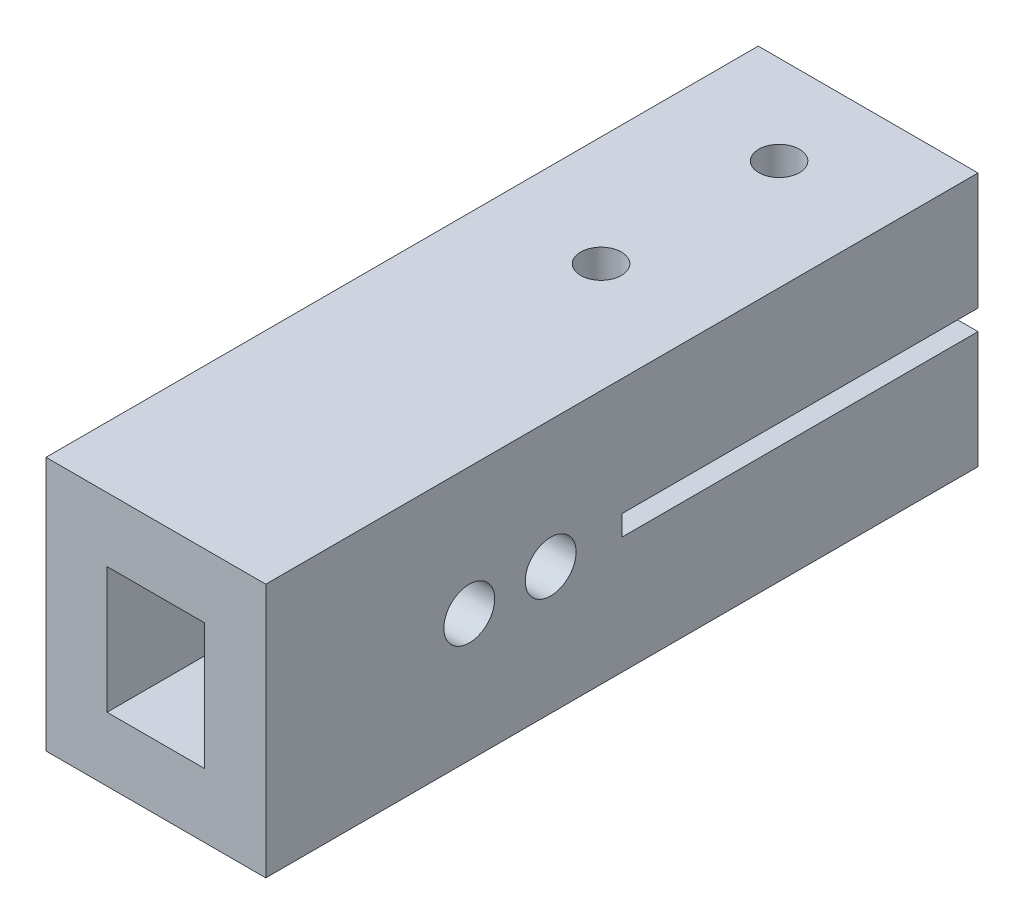
ISO-10303-21;
HEADER;
FILE_DESCRIPTION(('STEP AP214'),'2;1');
FILE_NAME('part.step','',(''),(''),'','','');
FILE_SCHEMA(('AUTOMOTIVE_DESIGN { 1 0 10303 214 1 1 1 1 }'));
ENDSEC;
DATA;
#1=APPLICATION_CONTEXT('core data for automotive mechanical design processes');
#2=APPLICATION_PROTOCOL_DEFINITION('international standard','automotive_design',2000,#1);
#3=PRODUCT_CONTEXT('',#1,'mechanical');
#4=PRODUCT('Part','Part','',(#3));
#5=PRODUCT_RELATED_PRODUCT_CATEGORY('part','',(#4));
#6=PRODUCT_DEFINITION_FORMATION('','',#4);
#7=PRODUCT_DEFINITION_CONTEXT('part definition',#1,'design');
#8=PRODUCT_DEFINITION('design','',#6,#7);
#9=PRODUCT_DEFINITION_SHAPE('','',#8);
#10=(LENGTH_UNIT() NAMED_UNIT(*) SI_UNIT(.MILLI.,.METRE.));
#11=(NAMED_UNIT(*) PLANE_ANGLE_UNIT() SI_UNIT($,.RADIAN.));
#12=(NAMED_UNIT(*) SI_UNIT($,.STERADIAN.) SOLID_ANGLE_UNIT());
#13=UNCERTAINTY_MEASURE_WITH_UNIT(LENGTH_MEASURE(1.E-05),#10,'distance_accuracy_value','');
#14=(GEOMETRIC_REPRESENTATION_CONTEXT(3) GLOBAL_UNCERTAINTY_ASSIGNED_CONTEXT((#13)) GLOBAL_UNIT_ASSIGNED_CONTEXT((#10,
#11,#12)) REPRESENTATION_CONTEXT('',''));
#15=CARTESIAN_POINT('',(0.,0.,0.));
#16=DIRECTION('',(0.,0.,1.));
#17=DIRECTION('',(1.,0.,0.));
#18=AXIS2_PLACEMENT_3D('',#15,#16,#17);
#19=CARTESIAN_POINT('',(-56.5626148851494,0.,-10.849521595488));
#20=DIRECTION('',(0.,0.,1.));
#21=DIRECTION('',(1.,0.,0.));
#22=AXIS2_PLACEMENT_3D('',#19,#20,#21);
#23=PLANE('',#22);
#24=DIRECTION('',(0.,-1.,0.));
#25=VECTOR('',#24,1.);
#26=CARTESIAN_POINT('',(-54.1626148851493,3.10000000000004,-10.849521595488));
#27=LINE('',#26,#25);
#28=CARTESIAN_POINT('',(-54.1626148851493,3.10000000000004,-10.849521595488));
#29=VERTEX_POINT('',#28);
#30=CARTESIAN_POINT('',(-54.1626148851493,-3.09999999999995,-10.849521595488));
#31=VERTEX_POINT('',#30);
#32=EDGE_CURVE('E11',#29,#31,#27,.T.);
#33=ORIENTED_EDGE('',*,*,#32,.T.);
#34=DIRECTION('',(-1.,0.,0.));
#35=VECTOR('',#34,1.);
#36=CARTESIAN_POINT('',(-54.1626148851493,-3.09999999999995,-10.849521595488));
#37=LINE('',#36,#35);
#38=CARTESIAN_POINT('',(-58.9626148851493,-3.09999999999995,-10.849521595488));
#39=VERTEX_POINT('',#38);
#40=EDGE_CURVE('E26',#31,#39,#37,.T.);
#41=ORIENTED_EDGE('',*,*,#40,.T.);
#42=DIRECTION('',(0.,1.,0.));
#43=VECTOR('',#42,1.);
#44=CARTESIAN_POINT('',(-58.9626148851493,-3.09999999999995,-10.849521595488));
#45=LINE('',#44,#43);
#46=CARTESIAN_POINT('',(-58.9626148851493,3.10000000000004,-10.849521595488));
#47=VERTEX_POINT('',#46);
#48=EDGE_CURVE('E393',#39,#47,#45,.T.);
#49=ORIENTED_EDGE('',*,*,#48,.T.);
#50=DIRECTION('',(1.,0.,0.));
#51=VECTOR('',#50,1.);
#52=CARTESIAN_POINT('',(-58.9626148851493,3.10000000000004,-10.849521595488));
#53=LINE('',#52,#51);
#54=EDGE_CURVE('E396',#47,#29,#53,.T.);
#55=ORIENTED_EDGE('',*,*,#54,.T.);
#56=EDGE_LOOP('',(#33,#41,#49,#55));
#57=FACE_BOUND('',#56,.T.);
#58=DIRECTION('',(0.,-1.,0.));
#59=VECTOR('',#58,1.);
#60=CARTESIAN_POINT('',(-61.9626148851493,6.25,-10.849521595488));
#61=LINE('',#60,#59);
#62=CARTESIAN_POINT('',(-61.9626148851493,6.25,-10.849521595488));
#63=VERTEX_POINT('',#62);
#64=CARTESIAN_POINT('',(-61.9626148851493,-6.25,-10.849521595488));
#65=VERTEX_POINT('',#64);
#66=EDGE_CURVE('E421',#63,#65,#61,.T.);
#67=ORIENTED_EDGE('',*,*,#66,.T.);
#68=DIRECTION('',(1.,0.,0.));
#69=VECTOR('',#68,1.);
#70=CARTESIAN_POINT('',(-61.9626148851493,-6.25,-10.849521595488));
#71=LINE('',#70,#69);
#72=CARTESIAN_POINT('',(-51.1626148851493,-6.25,-10.849521595488));
#73=VERTEX_POINT('',#72);
#74=EDGE_CURVE('E329',#65,#73,#71,.T.);
#75=ORIENTED_EDGE('',*,*,#74,.T.);
#76=DIRECTION('',(0.,1.,0.));
#77=VECTOR('',#76,1.);
#78=CARTESIAN_POINT('',(-51.1626148851493,-6.25,-10.849521595488));
#79=LINE('',#78,#77);
#80=CARTESIAN_POINT('',(-51.1626148851493,6.25,-10.849521595488));
#81=VERTEX_POINT('',#80);
#82=EDGE_CURVE('E326',#73,#81,#79,.T.);
#83=ORIENTED_EDGE('',*,*,#82,.T.);
#84=DIRECTION('',(-1.,0.,0.));
#85=VECTOR('',#84,1.);
#86=CARTESIAN_POINT('',(-51.1626148851493,6.25,-10.849521595488));
#87=LINE('',#86,#85);
#88=EDGE_CURVE('E330',#81,#63,#87,.T.);
#89=ORIENTED_EDGE('',*,*,#88,.T.);
#90=EDGE_LOOP('',(#67,#75,#83,#89));
#91=FACE_BOUND('',#90,.T.);
#92=ADVANCED_FACE('F16',(#57,#91),#23,.T.);
#93=CARTESIAN_POINT('',(-58.9626148851493,-6.25,-45.849521595488));
#94=DIRECTION('',(0.,-1.,0.));
#95=DIRECTION('',(0.,0.,1.));
#96=AXIS2_PLACEMENT_3D('',#93,#94,#95);
#97=PLANE('',#96);
#98=DIRECTION('',(0.,0.,1.));
#99=VECTOR('',#98,1.);
#100=CARTESIAN_POINT('',(-61.9626148851493,-6.25,-11.849521595488));
#101=LINE('',#100,#99);
#102=CARTESIAN_POINT('',(-61.9626148851493,-6.25,-45.849521595488));
#103=VERTEX_POINT('',#102);
#104=EDGE_CURVE('E352',#103,#65,#101,.T.);
#105=ORIENTED_EDGE('',*,*,#104,.F.);
#106=DIRECTION('',(1.,0.,0.));
#107=VECTOR('',#106,1.);
#108=CARTESIAN_POINT('',(-58.9626148851493,-6.25,-45.849521595488));
#109=LINE('',#108,#107);
#110=CARTESIAN_POINT('',(-51.1626148851493,-6.25,-45.849521595488));
#111=VERTEX_POINT('',#110);
#112=EDGE_CURVE('E293',#103,#111,#109,.T.);
#113=ORIENTED_EDGE('',*,*,#112,.T.);
#114=DIRECTION('',(0.,0.,-1.));
#115=VECTOR('',#114,1.);
#116=CARTESIAN_POINT('',(-51.1626148851493,-6.25,-38.3495215954879));
#117=LINE('',#116,#115);
#118=EDGE_CURVE('E392',#73,#111,#117,.T.);
#119=ORIENTED_EDGE('',*,*,#118,.F.);
#120=ORIENTED_EDGE('',*,*,#74,.F.);
#121=EDGE_LOOP('',(#105,#113,#119,#120));
#122=FACE_BOUND('',#121,.T.);
#123=CARTESIAN_POINT('',(-56.5626148851493,-6.25,-32.7245215954879));
#124=DIRECTION('',(0.,1.,0.));
#125=DIRECTION('',(-1.,0.,0.));
#126=AXIS2_PLACEMENT_3D('',#123,#124,#125);
#127=CIRCLE('',#126,1.);
#128=CARTESIAN_POINT('',(-55.5626148851493,-6.25,-32.7245215954879));
#129=VERTEX_POINT('',#128);
#130=EDGE_CURVE('E291',#129,#129,#127,.T.);
#131=ORIENTED_EDGE('',*,*,#130,.T.);
#132=EDGE_LOOP('',(#131));
#133=FACE_BOUND('',#132,.T.);
#134=CARTESIAN_POINT('',(-56.5626148851493,-6.25,-41.4745215954879));
#135=DIRECTION('',(0.,1.,0.));
#136=DIRECTION('',(-1.,0.,0.));
#137=AXIS2_PLACEMENT_3D('',#134,#135,#136);
#138=CIRCLE('',#137,1.);
#139=CARTESIAN_POINT('',(-55.5626148851493,-6.25,-41.4745215954879));
#140=VERTEX_POINT('',#139);
#141=EDGE_CURVE('E267',#140,#140,#138,.T.);
#142=ORIENTED_EDGE('',*,*,#141,.T.);
#143=EDGE_LOOP('',(#142));
#144=FACE_BOUND('',#143,.T.);
#145=ADVANCED_FACE('F496',(#122,#133,#144),#97,.T.);
#146=CARTESIAN_POINT('',(-61.9626148851493,-1.24999999999995,-30.849521595488));
#147=DIRECTION('',(-1.,0.,0.));
#148=DIRECTION('',(0.,-1.,0.));
#149=AXIS2_PLACEMENT_3D('',#146,#147,#148);
#150=PLANE('',#149);
#151=CARTESIAN_POINT('',(-61.9626148851493,0.,-24.8495215954879));
#152=DIRECTION('',(1.,0.,0.));
#153=DIRECTION('',(0.,-1.,0.));
#154=AXIS2_PLACEMENT_3D('',#151,#152,#153);
#155=CIRCLE('',#154,1.25);
#156=CARTESIAN_POINT('',(-61.9626148851493,1.25000000000005,-24.8495215954879));
#157=VERTEX_POINT('',#156);
#158=EDGE_CURVE('E264',#157,#157,#155,.T.);
#159=ORIENTED_EDGE('',*,*,#158,.T.);
#160=EDGE_LOOP('',(#159));
#161=FACE_BOUND('',#160,.T.);
#162=CARTESIAN_POINT('',(-61.9626148851493,0.,-20.8495215954879));
#163=DIRECTION('',(1.,0.,0.));
#164=DIRECTION('',(0.,-1.,0.));
#165=AXIS2_PLACEMENT_3D('',#162,#163,#164);
#166=CIRCLE('',#165,1.25);
#167=CARTESIAN_POINT('',(-61.9626148851493,1.25000000000005,-20.8495215954879));
#168=VERTEX_POINT('',#167);
#169=EDGE_CURVE('E268',#168,#168,#166,.T.);
#170=ORIENTED_EDGE('',*,*,#169,.T.);
#171=EDGE_LOOP('',(#170));
#172=FACE_BOUND('',#171,.T.);
#173=DIRECTION('',(0.,0.,-1.));
#174=VECTOR('',#173,1.);
#175=CARTESIAN_POINT('',(-61.9626148851493,6.25,-38.3495215954879));
#176=LINE('',#175,#174);
#177=CARTESIAN_POINT('',(-61.9626148851493,6.25,-45.849521595488));
#178=VERTEX_POINT('',#177);
#179=EDGE_CURVE('E343',#63,#178,#176,.T.);
#180=ORIENTED_EDGE('',*,*,#179,.T.);
#181=DIRECTION('',(0.,-1.,0.));
#182=VECTOR('',#181,1.);
#183=CARTESIAN_POINT('',(-61.9626148851493,1.87500000000005,-45.849521595488));
#184=LINE('',#183,#182);
#185=CARTESIAN_POINT('',(-61.9626148851493,0.500000000000049,-45.849521595488));
#186=VERTEX_POINT('',#185);
#187=EDGE_CURVE('E346',#178,#186,#184,.T.);
#188=ORIENTED_EDGE('',*,*,#187,.T.);
#189=DIRECTION('',(0.,0.,1.));
#190=VECTOR('',#189,1.);
#191=CARTESIAN_POINT('',(-61.9626148851493,0.500000000000049,-38.3495215954879));
#192=LINE('',#191,#190);
#193=CARTESIAN_POINT('',(-61.9626148851493,0.500000000000049,-28.3495215954879));
#194=VERTEX_POINT('',#193);
#195=EDGE_CURVE('E231',#186,#194,#192,.T.);
#196=ORIENTED_EDGE('',*,*,#195,.T.);
#197=DIRECTION('',(0.,-1.,0.));
#198=VECTOR('',#197,1.);
#199=CARTESIAN_POINT('',(-61.9626148851493,-0.624999999999952,-28.3495215954879));
#200=LINE('',#199,#198);
#201=CARTESIAN_POINT('',(-61.9626148851493,-0.499999999999951,-28.3495215954879));
#202=VERTEX_POINT('',#201);
#203=EDGE_CURVE('E375',#194,#202,#200,.T.);
#204=ORIENTED_EDGE('',*,*,#203,.T.);
#205=DIRECTION('',(0.,0.,-1.));
#206=VECTOR('',#205,1.);
#207=CARTESIAN_POINT('',(-61.9626148851493,-0.499999999999951,-38.3495215954879));
#208=LINE('',#207,#206);
#209=CARTESIAN_POINT('',(-61.9626148851493,-0.499999999999951,-45.849521595488));
#210=VERTEX_POINT('',#209);
#211=EDGE_CURVE('E378',#202,#210,#208,.T.);
#212=ORIENTED_EDGE('',*,*,#211,.T.);
#213=DIRECTION('',(0.,-1.,0.));
#214=VECTOR('',#213,1.);
#215=CARTESIAN_POINT('',(-61.9626148851493,1.87500000000005,-45.849521595488));
#216=LINE('',#215,#214);
#217=EDGE_CURVE('E358',#210,#103,#216,.T.);
#218=ORIENTED_EDGE('',*,*,#217,.T.);
#219=ORIENTED_EDGE('',*,*,#104,.T.);
#220=ORIENTED_EDGE('',*,*,#66,.F.);
#221=EDGE_LOOP('',(#180,#188,#196,#204,#212,#218,#219,#220));
#222=FACE_BOUND('',#221,.T.);
#223=ADVANCED_FACE('F498',(#161,#172,#222),#150,.T.);
#224=CARTESIAN_POINT('',(-54.1626148851493,0.750000000000047,-30.849521595488));
#225=DIRECTION('',(1.,0.,0.));
#226=DIRECTION('',(0.,1.,0.));
#227=AXIS2_PLACEMENT_3D('',#224,#225,#226);
#228=PLANE('',#227);
#229=CARTESIAN_POINT('',(-54.1626148851493,0.,-20.8495215954879));
#230=DIRECTION('',(-1.,0.,0.));
#231=DIRECTION('',(0.,0.973831149346752,-0.227272727272728));
#232=AXIS2_PLACEMENT_3D('',#229,#230,#231);
#233=CIRCLE('',#232,2.8);
#234=CARTESIAN_POINT('',(-54.1626148851493,-2.72672721817087,-21.4858852318516));
#235=VERTEX_POINT('',#234);
#236=CARTESIAN_POINT('',(-54.1626148851493,2.72672721817096,-21.4858852318516));
#237=VERTEX_POINT('',#236);
#238=EDGE_CURVE('E311',#235,#237,#233,.T.);
#239=ORIENTED_EDGE('',*,*,#238,.F.);
#240=CARTESIAN_POINT('',(-54.1626148851493,-8.56971411425136,-22.849521595488));
#241=DIRECTION('',(1.,0.,0.));
#242=DIRECTION('',(0.,0.973831149346752,-0.227272727272727));
#243=AXIS2_PLACEMENT_3D('',#240,#241,#242);
#244=CIRCLE('',#243,6.);
#245=CARTESIAN_POINT('',(-54.1626148851493,-2.72672721817086,-24.2131579591244));
#246=VERTEX_POINT('',#245);
#247=EDGE_CURVE('E306',#246,#235,#244,.T.);
#248=ORIENTED_EDGE('',*,*,#247,.F.);
#249=CARTESIAN_POINT('',(-54.1626148851493,0.,-24.8495215954879));
#250=DIRECTION('',(-1.,0.,0.));
#251=DIRECTION('',(0.,-0.973831149346752,0.227272727272728));
#252=AXIS2_PLACEMENT_3D('',#249,#250,#251);
#253=CIRCLE('',#252,2.8);
#254=CARTESIAN_POINT('',(-54.1626148851493,2.72672721817096,-24.2131579591244));
#255=VERTEX_POINT('',#254);
#256=EDGE_CURVE('E307',#255,#246,#253,.T.);
#257=ORIENTED_EDGE('',*,*,#256,.F.);
#258=CARTESIAN_POINT('',(-54.1626148851493,8.56971411425149,-22.849521595488));
#259=DIRECTION('',(1.,0.,0.));
#260=DIRECTION('',(0.,-0.973831149346752,0.227272727272728));
#261=AXIS2_PLACEMENT_3D('',#258,#259,#260);
#262=CIRCLE('',#261,6.);
#263=EDGE_CURVE('E325',#237,#255,#262,.T.);
#264=ORIENTED_EDGE('',*,*,#263,.F.);
#265=EDGE_LOOP('',(#239,#248,#257,#264));
#266=FACE_BOUND('',#265,.T.);
#267=DIRECTION('',(0.,0.,-1.));
#268=VECTOR('',#267,1.);
#269=CARTESIAN_POINT('',(-54.1626148851493,3.10000000000004,-20.8805156000112));
#270=LINE('',#269,#268);
#271=CARTESIAN_POINT('',(-54.1626148851493,3.10000000000004,-28.3495215954879));
#272=VERTEX_POINT('',#271);
#273=EDGE_CURVE('E350',#29,#272,#270,.T.);
#274=ORIENTED_EDGE('',*,*,#273,.T.);
#275=DIRECTION('',(0.,-1.,0.));
#276=VECTOR('',#275,1.);
#277=CARTESIAN_POINT('',(-54.1626148851493,1.92500000000005,-28.3495215954879));
#278=LINE('',#277,#276);
#279=CARTESIAN_POINT('',(-54.1626148851493,2.10000000000004,-28.3495215954879));
#280=VERTEX_POINT('',#279);
#281=EDGE_CURVE('E286',#272,#280,#278,.T.);
#282=ORIENTED_EDGE('',*,*,#281,.T.);
#283=DIRECTION('',(0.,0.,-1.));
#284=VECTOR('',#283,1.);
#285=CARTESIAN_POINT('',(-54.1626148851493,2.10000000000004,-33.9745215954879));
#286=LINE('',#285,#284);
#287=CARTESIAN_POINT('',(-54.1626148851493,2.10000000000004,-45.849521595488));
#288=VERTEX_POINT('',#287);
#289=EDGE_CURVE('E283',#280,#288,#286,.T.);
#290=ORIENTED_EDGE('',*,*,#289,.T.);
#291=DIRECTION('',(0.,-1.,0.));
#292=VECTOR('',#291,1.);
#293=CARTESIAN_POINT('',(-54.1626148851493,5.,-45.849521595488));
#294=LINE('',#293,#292);
#295=CARTESIAN_POINT('',(-54.1626148851493,0.500000000000049,-45.849521595488));
#296=VERTEX_POINT('',#295);
#297=EDGE_CURVE('E282',#288,#296,#294,.T.);
#298=ORIENTED_EDGE('',*,*,#297,.T.);
#299=DIRECTION('',(0.,0.,1.));
#300=VECTOR('',#299,1.);
#301=CARTESIAN_POINT('',(-54.1626148851493,0.500000000000049,-38.3495215954879));
#302=LINE('',#301,#300);
#303=CARTESIAN_POINT('',(-54.1626148851493,0.500000000000049,-28.3495215954879));
#304=VERTEX_POINT('',#303);
#305=EDGE_CURVE('E247',#296,#304,#302,.T.);
#306=ORIENTED_EDGE('',*,*,#305,.T.);
#307=DIRECTION('',(0.,-1.,0.));
#308=VECTOR('',#307,1.);
#309=CARTESIAN_POINT('',(-54.1626148851493,0.375000000000047,-28.3495215954879));
#310=LINE('',#309,#308);
#311=CARTESIAN_POINT('',(-54.1626148851493,-0.499999999999951,-28.3495215954879));
#312=VERTEX_POINT('',#311);
#313=EDGE_CURVE('E244',#304,#312,#310,.T.);
#314=ORIENTED_EDGE('',*,*,#313,.T.);
#315=DIRECTION('',(0.,0.,-1.));
#316=VECTOR('',#315,1.);
#317=CARTESIAN_POINT('',(-54.1626148851493,-0.499999999999951,-38.3495215954879));
#318=LINE('',#317,#316);
#319=CARTESIAN_POINT('',(-54.1626148851493,-0.499999999999951,-45.849521595488));
#320=VERTEX_POINT('',#319);
#321=EDGE_CURVE('E20',#312,#320,#318,.T.);
#322=ORIENTED_EDGE('',*,*,#321,.T.);
#323=DIRECTION('',(0.,-1.,0.));
#324=VECTOR('',#323,1.);
#325=CARTESIAN_POINT('',(-54.1626148851493,5.,-45.849521595488));
#326=LINE('',#325,#324);
#327=CARTESIAN_POINT('',(-54.1626148851493,-2.09999999999995,-45.849521595488));
#328=VERTEX_POINT('',#327);
#329=EDGE_CURVE('E367',#320,#328,#326,.T.);
#330=ORIENTED_EDGE('',*,*,#329,.T.);
#331=DIRECTION('',(0.,0.,1.));
#332=VECTOR('',#331,1.);
#333=CARTESIAN_POINT('',(-54.1626148851493,-2.09999999999995,-33.9745215954879));
#334=LINE('',#333,#332);
#335=CARTESIAN_POINT('',(-54.1626148851493,-2.09999999999995,-28.3495215954879));
#336=VERTEX_POINT('',#335);
#337=EDGE_CURVE('E369',#328,#336,#334,.T.);
#338=ORIENTED_EDGE('',*,*,#337,.T.);
#339=DIRECTION('',(0.,-1.,0.));
#340=VECTOR('',#339,1.);
#341=CARTESIAN_POINT('',(-54.1626148851493,-1.17499999999995,-28.3495215954879));
#342=LINE('',#341,#340);
#343=CARTESIAN_POINT('',(-54.1626148851493,-3.09999999999995,-28.3495215954879));
#344=VERTEX_POINT('',#343);
#345=EDGE_CURVE('E316',#336,#344,#342,.T.);
#346=ORIENTED_EDGE('',*,*,#345,.T.);
#347=DIRECTION('',(0.,0.,-1.));
#348=VECTOR('',#347,1.);
#349=CARTESIAN_POINT('',(-54.1626148851493,-3.09999999999995,-38.3495215954879));
#350=LINE('',#349,#348);
#351=EDGE_CURVE('E295',#31,#344,#350,.T.);
#352=ORIENTED_EDGE('',*,*,#351,.F.);
#353=ORIENTED_EDGE('',*,*,#32,.F.);
#354=EDGE_LOOP('',(#274,#282,#290,#298,#306,#314,#322,#330,#338,#346,#352,#353));
#355=FACE_BOUND('',#354,.T.);
#356=ADVANCED_FACE('F506',(#266,#355),#228,.F.);
#357=CARTESIAN_POINT('',(-54.1626148851493,3.10000000000004,-45.849521595488));
#358=DIRECTION('',(0.,-1.,0.));
#359=DIRECTION('',(0.,0.,1.));
#360=AXIS2_PLACEMENT_3D('',#357,#358,#359);
#361=PLANE('',#360);
#362=DIRECTION('',(0.,0.,1.));
#363=VECTOR('',#362,1.);
#364=CARTESIAN_POINT('',(-58.9626148851493,3.10000000000004,-11.849521595488));
#365=LINE('',#364,#363);
#366=CARTESIAN_POINT('',(-58.9626148851493,3.10000000000004,-28.3495215954879));
#367=VERTEX_POINT('',#366);
#368=EDGE_CURVE('E338',#367,#47,#365,.T.);
#369=ORIENTED_EDGE('',*,*,#368,.F.);
#370=DIRECTION('',(1.,0.,0.));
#371=VECTOR('',#370,1.);
#372=CARTESIAN_POINT('',(-54.1626148851493,3.10000000000004,-28.3495215954879));
#373=LINE('',#372,#371);
#374=EDGE_CURVE('E313',#367,#272,#373,.T.);
#375=ORIENTED_EDGE('',*,*,#374,.T.);
#376=ORIENTED_EDGE('',*,*,#273,.F.);
#377=ORIENTED_EDGE('',*,*,#54,.F.);
#378=EDGE_LOOP('',(#369,#375,#376,#377));
#379=FACE_BOUND('',#378,.T.);
#380=ADVANCED_FACE('F18',(#379),#361,.T.);
#381=CARTESIAN_POINT('',(-54.1626148851493,3.10000000000004,-28.3495215954879));
#382=DIRECTION('',(0.,0.,1.));
#383=DIRECTION('',(-1.,0.,0.));
#384=AXIS2_PLACEMENT_3D('',#381,#382,#383);
#385=PLANE('',#384);
#386=ORIENTED_EDGE('',*,*,#374,.F.);
#387=DIRECTION('',(0.,1.,0.));
#388=VECTOR('',#387,1.);
#389=CARTESIAN_POINT('',(-58.9626148851493,0.925000000000047,-28.3495215954879));
#390=LINE('',#389,#388);
#391=CARTESIAN_POINT('',(-58.9626148851493,2.10000000000004,-28.3495215954879));
#392=VERTEX_POINT('',#391);
#393=EDGE_CURVE('E341',#392,#367,#390,.T.);
#394=ORIENTED_EDGE('',*,*,#393,.F.);
#395=DIRECTION('',(-1.,0.,0.));
#396=VECTOR('',#395,1.);
#397=CARTESIAN_POINT('',(-58.9626148851493,2.10000000000004,-28.3495215954879));
#398=LINE('',#397,#396);
#399=EDGE_CURVE('E249',#280,#392,#398,.T.);
#400=ORIENTED_EDGE('',*,*,#399,.F.);
#401=ORIENTED_EDGE('',*,*,#281,.F.);
#402=EDGE_LOOP('',(#386,#394,#400,#401));
#403=FACE_BOUND('',#402,.T.);
#404=ADVANCED_FACE('F568',(#403),#385,.T.);
#405=CARTESIAN_POINT('',(-56.5626148851493,2.10000000000004,-37.099521595488));
#406=DIRECTION('',(0.,-1.,0.));
#407=DIRECTION('',(1.,0.,0.));
#408=AXIS2_PLACEMENT_3D('',#405,#406,#407);
#409=PLANE('',#408);
#410=CARTESIAN_POINT('',(-56.5626148851493,2.10000000000004,-41.4745215954879));
#411=DIRECTION('',(0.,1.,0.));
#412=DIRECTION('',(1.,0.,0.));
#413=AXIS2_PLACEMENT_3D('',#410,#411,#412);
#414=CIRCLE('',#413,1.);
#415=CARTESIAN_POINT('',(-57.5626148851493,2.10000000000004,-41.4745215954879));
#416=VERTEX_POINT('',#415);
#417=EDGE_CURVE('E317',#416,#416,#414,.T.);
#418=ORIENTED_EDGE('',*,*,#417,.T.);
#419=EDGE_LOOP('',(#418));
#420=FACE_BOUND('',#419,.T.);
#421=CARTESIAN_POINT('',(-56.5626148851493,2.10000000000004,-32.7245215954879));
#422=DIRECTION('',(0.,1.,0.));
#423=DIRECTION('',(1.,0.,0.));
#424=AXIS2_PLACEMENT_3D('',#421,#422,#423);
#425=CIRCLE('',#424,1.);
#426=CARTESIAN_POINT('',(-57.5626148851493,2.10000000000004,-32.7245215954879));
#427=VERTEX_POINT('',#426);
#428=EDGE_CURVE('E302',#427,#427,#425,.T.);
#429=ORIENTED_EDGE('',*,*,#428,.T.);
#430=EDGE_LOOP('',(#429));
#431=FACE_BOUND('',#430,.T.);
#432=ORIENTED_EDGE('',*,*,#399,.T.);
#433=DIRECTION('',(0.,0.,1.));
#434=VECTOR('',#433,1.);
#435=CARTESIAN_POINT('',(-58.9626148851493,2.10000000000004,-33.9745215954879));
#436=LINE('',#435,#434);
#437=CARTESIAN_POINT('',(-58.9626148851493,2.10000000000004,-45.849521595488));
#438=VERTEX_POINT('',#437);
#439=EDGE_CURVE('E227',#438,#392,#436,.T.);
#440=ORIENTED_EDGE('',*,*,#439,.F.);
#441=DIRECTION('',(1.,0.,0.));
#442=VECTOR('',#441,1.);
#443=CARTESIAN_POINT('',(-54.1626148851493,2.10000000000004,-45.849521595488));
#444=LINE('',#443,#442);
#445=EDGE_CURVE('E212',#438,#288,#444,.T.);
#446=ORIENTED_EDGE('',*,*,#445,.T.);
#447=ORIENTED_EDGE('',*,*,#289,.F.);
#448=EDGE_LOOP('',(#432,#440,#446,#447));
#449=FACE_BOUND('',#448,.T.);
#450=ADVANCED_FACE('F564',(#420,#431,#449),#409,.T.);
#451=CARTESIAN_POINT('',(-58.9626148851493,-3.09999999999995,-28.3495215954879));
#452=DIRECTION('',(0.,0.,1.));
#453=DIRECTION('',(1.,0.,0.));
#454=AXIS2_PLACEMENT_3D('',#451,#452,#453);
#455=PLANE('',#454);
#456=DIRECTION('',(-1.,0.,0.));
#457=VECTOR('',#456,1.);
#458=CARTESIAN_POINT('',(-58.9626148851493,-3.09999999999995,-28.3495215954879));
#459=LINE('',#458,#457);
#460=CARTESIAN_POINT('',(-58.9626148851493,-3.09999999999995,-28.3495215954879));
#461=VERTEX_POINT('',#460);
#462=EDGE_CURVE('E242',#344,#461,#459,.T.);
#463=ORIENTED_EDGE('',*,*,#462,.F.);
#464=ORIENTED_EDGE('',*,*,#345,.F.);
#465=DIRECTION('',(1.,0.,0.));
#466=VECTOR('',#465,1.);
#467=CARTESIAN_POINT('',(-58.9626148851493,-2.09999999999995,-28.3495215954879));
#468=LINE('',#467,#466);
#469=CARTESIAN_POINT('',(-58.9626148851493,-2.09999999999995,-28.3495215954879));
#470=VERTEX_POINT('',#469);
#471=EDGE_CURVE('E251',#470,#336,#468,.T.);
#472=ORIENTED_EDGE('',*,*,#471,.F.);
#473=DIRECTION('',(0.,1.,0.));
#474=VECTOR('',#473,1.);
#475=CARTESIAN_POINT('',(-58.9626148851493,-2.17499999999995,-28.3495215954879));
#476=LINE('',#475,#474);
#477=EDGE_CURVE('E269',#461,#470,#476,.T.);
#478=ORIENTED_EDGE('',*,*,#477,.F.);
#479=EDGE_LOOP('',(#463,#464,#472,#478));
#480=FACE_BOUND('',#479,.T.);
#481=ADVANCED_FACE('F567',(#480),#455,.T.);
#482=CARTESIAN_POINT('',(-56.5626148851493,-2.09999999999995,-37.099521595488));
#483=DIRECTION('',(0.,1.,0.));
#484=DIRECTION('',(-1.,0.,0.));
#485=AXIS2_PLACEMENT_3D('',#482,#483,#484);
#486=PLANE('',#485);
#487=CARTESIAN_POINT('',(-56.5626148851493,-2.09999999999995,-32.7245215954879));
#488=DIRECTION('',(0.,-1.,0.));
#489=DIRECTION('',(-1.,0.,0.));
#490=AXIS2_PLACEMENT_3D('',#487,#488,#489);
#491=CIRCLE('',#490,1.);
#492=CARTESIAN_POINT('',(-55.5626148851493,-2.09999999999995,-32.7245215954879));
#493=VERTEX_POINT('',#492);
#494=EDGE_CURVE('E250',#493,#493,#491,.T.);
#495=ORIENTED_EDGE('',*,*,#494,.T.);
#496=EDGE_LOOP('',(#495));
#497=FACE_BOUND('',#496,.T.);
#498=CARTESIAN_POINT('',(-56.5626148851493,-2.09999999999995,-41.4745215954879));
#499=DIRECTION('',(0.,-1.,0.));
#500=DIRECTION('',(-1.,0.,0.));
#501=AXIS2_PLACEMENT_3D('',#498,#499,#500);
#502=CIRCLE('',#501,1.);
#503=CARTESIAN_POINT('',(-55.5626148851493,-2.09999999999995,-41.4745215954879));
#504=VERTEX_POINT('',#503);
#505=EDGE_CURVE('E274',#504,#504,#502,.T.);
#506=ORIENTED_EDGE('',*,*,#505,.T.);
#507=EDGE_LOOP('',(#506));
#508=FACE_BOUND('',#507,.T.);
#509=ORIENTED_EDGE('',*,*,#337,.F.);
#510=DIRECTION('',(-1.,0.,0.));
#511=VECTOR('',#510,1.);
#512=CARTESIAN_POINT('',(-54.1626148851493,-2.09999999999995,-45.849521595488));
#513=LINE('',#512,#511);
#514=CARTESIAN_POINT('',(-58.9626148851493,-2.09999999999995,-45.849521595488));
#515=VERTEX_POINT('',#514);
#516=EDGE_CURVE('E254',#328,#515,#513,.T.);
#517=ORIENTED_EDGE('',*,*,#516,.T.);
#518=DIRECTION('',(0.,0.,-1.));
#519=VECTOR('',#518,1.);
#520=CARTESIAN_POINT('',(-58.9626148851493,-2.09999999999995,-33.9745215954879));
#521=LINE('',#520,#519);
#522=EDGE_CURVE('E271',#470,#515,#521,.T.);
#523=ORIENTED_EDGE('',*,*,#522,.F.);
#524=ORIENTED_EDGE('',*,*,#471,.T.);
#525=EDGE_LOOP('',(#509,#517,#523,#524));
#526=FACE_BOUND('',#525,.T.);
#527=ADVANCED_FACE('F487',(#497,#508,#526),#486,.T.);
#528=CARTESIAN_POINT('',(-58.9626148851493,-1.24999999999995,-30.849521595488));
#529=DIRECTION('',(-1.,0.,0.));
#530=DIRECTION('',(0.,-1.,0.));
#531=AXIS2_PLACEMENT_3D('',#528,#529,#530);
#532=PLANE('',#531);
#533=DIRECTION('',(0.,0.,-1.));
#534=VECTOR('',#533,1.);
#535=CARTESIAN_POINT('',(-58.9626148851493,-3.09999999999995,-38.3495215954879));
#536=LINE('',#535,#534);
#537=EDGE_CURVE('E255',#39,#461,#536,.T.);
#538=ORIENTED_EDGE('',*,*,#537,.T.);
#539=ORIENTED_EDGE('',*,*,#477,.T.);
#540=ORIENTED_EDGE('',*,*,#522,.T.);
#541=DIRECTION('',(0.,-1.,0.));
#542=VECTOR('',#541,1.);
#543=CARTESIAN_POINT('',(-58.9626148851493,5.,-45.849521595488));
#544=LINE('',#543,#542);
#545=CARTESIAN_POINT('',(-58.9626148851493,-0.499999999999951,-45.849521595488));
#546=VERTEX_POINT('',#545);
#547=EDGE_CURVE('E336',#546,#515,#544,.T.);
#548=ORIENTED_EDGE('',*,*,#547,.F.);
#549=DIRECTION('',(0.,0.,1.));
#550=VECTOR('',#549,1.);
#551=CARTESIAN_POINT('',(-58.9626148851493,-0.499999999999951,-38.3495215954879));
#552=LINE('',#551,#550);
#553=CARTESIAN_POINT('',(-58.9626148851493,-0.499999999999951,-28.3495215954879));
#554=VERTEX_POINT('',#553);
#555=EDGE_CURVE('E299',#546,#554,#552,.T.);
#556=ORIENTED_EDGE('',*,*,#555,.T.);
#557=DIRECTION('',(0.,1.,0.));
#558=VECTOR('',#557,1.);
#559=CARTESIAN_POINT('',(-58.9626148851493,-0.624999999999952,-28.3495215954879));
#560=LINE('',#559,#558);
#561=CARTESIAN_POINT('',(-58.9626148851493,0.500000000000049,-28.3495215954879));
#562=VERTEX_POINT('',#561);
#563=EDGE_CURVE('E223',#554,#562,#560,.T.);
#564=ORIENTED_EDGE('',*,*,#563,.T.);
#565=DIRECTION('',(0.,0.,-1.));
#566=VECTOR('',#565,1.);
#567=CARTESIAN_POINT('',(-58.9626148851493,0.500000000000049,-38.3495215954879));
#568=LINE('',#567,#566);
#569=CARTESIAN_POINT('',(-58.9626148851493,0.500000000000049,-45.849521595488));
#570=VERTEX_POINT('',#569);
#571=EDGE_CURVE('E218',#562,#570,#568,.T.);
#572=ORIENTED_EDGE('',*,*,#571,.T.);
#573=DIRECTION('',(0.,-1.,0.));
#574=VECTOR('',#573,1.);
#575=CARTESIAN_POINT('',(-58.9626148851493,5.,-45.849521595488));
#576=LINE('',#575,#574);
#577=EDGE_CURVE('E206',#438,#570,#576,.T.);
#578=ORIENTED_EDGE('',*,*,#577,.F.);
#579=ORIENTED_EDGE('',*,*,#439,.T.);
#580=ORIENTED_EDGE('',*,*,#393,.T.);
#581=ORIENTED_EDGE('',*,*,#368,.T.);
#582=ORIENTED_EDGE('',*,*,#48,.F.);
#583=EDGE_LOOP('',(#538,#539,#540,#548,#556,#564,#572,#578,#579,#580,#581,#582));
#584=FACE_BOUND('',#583,.T.);
#585=CARTESIAN_POINT('',(-58.9626148851493,0.,-20.8495215954879));
#586=DIRECTION('',(1.,0.,0.));
#587=DIRECTION('',(0.,-1.,0.));
#588=AXIS2_PLACEMENT_3D('',#585,#586,#587);
#589=CIRCLE('',#588,1.25);
#590=CARTESIAN_POINT('',(-58.9626148851493,1.25000000000005,-20.8495215954879));
#591=VERTEX_POINT('',#590);
#592=EDGE_CURVE('E237',#591,#591,#589,.T.);
#593=ORIENTED_EDGE('',*,*,#592,.F.);
#594=EDGE_LOOP('',(#593));
#595=FACE_BOUND('',#594,.T.);
#596=CARTESIAN_POINT('',(-58.9626148851493,0.,-24.8495215954879));
#597=DIRECTION('',(1.,0.,0.));
#598=DIRECTION('',(0.,-1.,0.));
#599=AXIS2_PLACEMENT_3D('',#596,#597,#598);
#600=CIRCLE('',#599,1.25);
#601=CARTESIAN_POINT('',(-58.9626148851493,1.25000000000005,-24.8495215954879));
#602=VERTEX_POINT('',#601);
#603=EDGE_CURVE('E233',#602,#602,#600,.T.);
#604=ORIENTED_EDGE('',*,*,#603,.F.);
#605=EDGE_LOOP('',(#604));
#606=FACE_BOUND('',#605,.T.);
#607=ADVANCED_FACE('F220',(#584,#595,#606),#532,.F.);
#608=CARTESIAN_POINT('',(-56.5626148851493,6.6,-41.4745215954879));
#609=DIRECTION('',(0.,1.,0.));
#610=DIRECTION('',(-1.,0.,0.));
#611=AXIS2_PLACEMENT_3D('',#608,#609,#610);
#612=CYLINDRICAL_SURFACE('',#611,1.);
#613=ORIENTED_EDGE('',*,*,#505,.F.);
#614=EDGE_LOOP('',(#613));
#615=FACE_BOUND('',#614,.T.);
#616=ORIENTED_EDGE('',*,*,#141,.F.);
#617=EDGE_LOOP('',(#616));
#618=FACE_BOUND('',#617,.T.);
#619=ADVANCED_FACE('F490',(#615,#618),#612,.F.);
#620=CARTESIAN_POINT('',(-56.5626148851493,6.6,-41.4745215954879));
#621=DIRECTION('',(0.,1.,0.));
#622=DIRECTION('',(-1.,0.,0.));
#623=AXIS2_PLACEMENT_3D('',#620,#621,#622);
#624=CYLINDRICAL_SURFACE('',#623,1.);
#625=ORIENTED_EDGE('',*,*,#417,.F.);
#626=EDGE_LOOP('',(#625));
#627=FACE_BOUND('',#626,.T.);
#628=CARTESIAN_POINT('',(-56.5626148851493,6.25,-41.4745215954879));
#629=DIRECTION('',(0.,-1.,0.));
#630=DIRECTION('',(-1.,0.,0.));
#631=AXIS2_PLACEMENT_3D('',#628,#629,#630);
#632=CIRCLE('',#631,1.);
#633=CARTESIAN_POINT('',(-55.5626148851493,6.25,-41.4745215954879));
#634=VERTEX_POINT('',#633);
#635=EDGE_CURVE('E312',#634,#634,#632,.T.);
#636=ORIENTED_EDGE('',*,*,#635,.F.);
#637=EDGE_LOOP('',(#636));
#638=FACE_BOUND('',#637,.T.);
#639=ADVANCED_FACE('F493',(#627,#638),#624,.F.);
#640=CARTESIAN_POINT('',(-56.5626148851493,6.6,-32.7245215954879));
#641=DIRECTION('',(0.,1.,0.));
#642=DIRECTION('',(-1.,0.,0.));
#643=AXIS2_PLACEMENT_3D('',#640,#641,#642);
#644=CYLINDRICAL_SURFACE('',#643,1.);
#645=ORIENTED_EDGE('',*,*,#494,.F.);
#646=EDGE_LOOP('',(#645));
#647=FACE_BOUND('',#646,.T.);
#648=ORIENTED_EDGE('',*,*,#130,.F.);
#649=EDGE_LOOP('',(#648));
#650=FACE_BOUND('',#649,.T.);
#651=ADVANCED_FACE('F535',(#647,#650),#644,.F.);
#652=CARTESIAN_POINT('',(-56.5626148851493,6.6,-32.7245215954879));
#653=DIRECTION('',(0.,1.,0.));
#654=DIRECTION('',(-1.,0.,0.));
#655=AXIS2_PLACEMENT_3D('',#652,#653,#654);
#656=CYLINDRICAL_SURFACE('',#655,1.);
#657=ORIENTED_EDGE('',*,*,#428,.F.);
#658=EDGE_LOOP('',(#657));
#659=FACE_BOUND('',#658,.T.);
#660=CARTESIAN_POINT('',(-56.5626148851493,6.25,-32.7245215954879));
#661=DIRECTION('',(0.,-1.,0.));
#662=DIRECTION('',(-1.,0.,0.));
#663=AXIS2_PLACEMENT_3D('',#660,#661,#662);
#664=CIRCLE('',#663,1.);
#665=CARTESIAN_POINT('',(-55.5626148851493,6.25,-32.7245215954879));
#666=VERTEX_POINT('',#665);
#667=EDGE_CURVE('E297',#666,#666,#664,.T.);
#668=ORIENTED_EDGE('',*,*,#667,.F.);
#669=EDGE_LOOP('',(#668));
#670=FACE_BOUND('',#669,.T.);
#671=ADVANCED_FACE('F473',(#659,#670),#656,.F.);
#672=CARTESIAN_POINT('',(-62.4626148851493,-0.499999999999951,-45.849521595488));
#673=DIRECTION('',(0.,-1.,0.));
#674=DIRECTION('',(1.,0.,0.));
#675=AXIS2_PLACEMENT_3D('',#672,#673,#674);
#676=PLANE('',#675);
#677=DIRECTION('',(1.,0.,0.));
#678=VECTOR('',#677,1.);
#679=CARTESIAN_POINT('',(-60.7126148851493,-0.499999999999951,-45.849521595488));
#680=LINE('',#679,#678);
#681=EDGE_CURVE('E437',#210,#546,#680,.T.);
#682=ORIENTED_EDGE('',*,*,#681,.F.);
#683=ORIENTED_EDGE('',*,*,#211,.F.);
#684=DIRECTION('',(1.,0.,0.));
#685=VECTOR('',#684,1.);
#686=CARTESIAN_POINT('',(-62.4626148851493,-0.499999999999951,-28.3495215954879));
#687=LINE('',#686,#685);
#688=EDGE_CURVE('E342',#202,#554,#687,.T.);
#689=ORIENTED_EDGE('',*,*,#688,.T.);
#690=ORIENTED_EDGE('',*,*,#555,.F.);
#691=EDGE_LOOP('',(#682,#683,#689,#690));
#692=FACE_BOUND('',#691,.T.);
#693=ADVANCED_FACE('F526',(#692),#676,.F.);
#694=CARTESIAN_POINT('',(-58.9626148851493,0.500000000000049,-45.849521595488));
#695=DIRECTION('',(0.,1.,0.));
#696=DIRECTION('',(-1.,0.,0.));
#697=AXIS2_PLACEMENT_3D('',#694,#695,#696);
#698=PLANE('',#697);
#699=DIRECTION('',(-1.,0.,0.));
#700=VECTOR('',#699,1.);
#701=CARTESIAN_POINT('',(-58.9626148851493,0.500000000000049,-45.849521595488));
#702=LINE('',#701,#700);
#703=EDGE_CURVE('E210',#570,#186,#702,.T.);
#704=ORIENTED_EDGE('',*,*,#703,.F.);
#705=ORIENTED_EDGE('',*,*,#571,.F.);
#706=DIRECTION('',(-1.,0.,0.));
#707=VECTOR('',#706,1.);
#708=CARTESIAN_POINT('',(-50.6626148851493,0.500000000000049,-28.3495215954879));
#709=LINE('',#708,#707);
#710=EDGE_CURVE('E278',#562,#194,#709,.T.);
#711=ORIENTED_EDGE('',*,*,#710,.T.);
#712=ORIENTED_EDGE('',*,*,#195,.F.);
#713=EDGE_LOOP('',(#704,#705,#711,#712));
#714=FACE_BOUND('',#713,.T.);
#715=ADVANCED_FACE('F229',(#714),#698,.F.);
#716=CARTESIAN_POINT('',(-60.7126148851493,0.,-28.3495215954879));
#717=DIRECTION('',(0.,0.,1.));
#718=DIRECTION('',(1.,0.,0.));
#719=AXIS2_PLACEMENT_3D('',#716,#717,#718);
#720=PLANE('',#719);
#721=ORIENTED_EDGE('',*,*,#563,.F.);
#722=ORIENTED_EDGE('',*,*,#688,.F.);
#723=ORIENTED_EDGE('',*,*,#203,.F.);
#724=ORIENTED_EDGE('',*,*,#710,.F.);
#725=EDGE_LOOP('',(#721,#722,#723,#724));
#726=FACE_BOUND('',#725,.T.);
#727=ADVANCED_FACE('F557',(#726),#720,.F.);
#728=CARTESIAN_POINT('',(-50.6626148851493,0.500000000000049,-45.849521595488));
#729=DIRECTION('',(0.,1.,0.));
#730=DIRECTION('',(-1.,0.,0.));
#731=AXIS2_PLACEMENT_3D('',#728,#729,#730);
#732=PLANE('',#731);
#733=DIRECTION('',(-1.,0.,0.));
#734=VECTOR('',#733,1.);
#735=CARTESIAN_POINT('',(-54.8126148851493,0.500000000000049,-45.849521595488));
#736=LINE('',#735,#734);
#737=CARTESIAN_POINT('',(-51.1626148851493,0.500000000000049,-45.849521595488));
#738=VERTEX_POINT('',#737);
#739=EDGE_CURVE('E215',#738,#296,#736,.T.);
#740=ORIENTED_EDGE('',*,*,#739,.F.);
#741=DIRECTION('',(0.,0.,-1.));
#742=VECTOR('',#741,1.);
#743=CARTESIAN_POINT('',(-51.1626148851493,0.500000000000049,-38.3495215954879));
#744=LINE('',#743,#742);
#745=CARTESIAN_POINT('',(-51.1626148851493,0.500000000000049,-28.3495215954879));
#746=VERTEX_POINT('',#745);
#747=EDGE_CURVE('E256',#746,#738,#744,.T.);
#748=ORIENTED_EDGE('',*,*,#747,.F.);
#749=DIRECTION('',(-1.,0.,0.));
#750=VECTOR('',#749,1.);
#751=CARTESIAN_POINT('',(-50.6626148851493,0.500000000000049,-28.3495215954879));
#752=LINE('',#751,#750);
#753=EDGE_CURVE('E275',#746,#304,#752,.T.);
#754=ORIENTED_EDGE('',*,*,#753,.T.);
#755=ORIENTED_EDGE('',*,*,#305,.F.);
#756=EDGE_LOOP('',(#740,#748,#754,#755));
#757=FACE_BOUND('',#756,.T.);
#758=ADVANCED_FACE('F520',(#757),#732,.F.);
#759=CARTESIAN_POINT('',(-54.1626148851493,-0.499999999999951,-45.849521595488));
#760=DIRECTION('',(0.,-1.,0.));
#761=DIRECTION('',(1.,0.,0.));
#762=AXIS2_PLACEMENT_3D('',#759,#760,#761);
#763=PLANE('',#762);
#764=DIRECTION('',(1.,0.,0.));
#765=VECTOR('',#764,1.);
#766=CARTESIAN_POINT('',(-56.5626148851493,-0.499999999999951,-45.849521595488));
#767=LINE('',#766,#765);
#768=CARTESIAN_POINT('',(-51.1626148851493,-0.499999999999952,-45.849521595488));
#769=VERTEX_POINT('',#768);
#770=EDGE_CURVE('E333',#320,#769,#767,.T.);
#771=ORIENTED_EDGE('',*,*,#770,.F.);
#772=ORIENTED_EDGE('',*,*,#321,.F.);
#773=DIRECTION('',(1.,0.,0.));
#774=VECTOR('',#773,1.);
#775=CARTESIAN_POINT('',(-62.4626148851493,-0.499999999999951,-28.3495215954879));
#776=LINE('',#775,#774);
#777=CARTESIAN_POINT('',(-51.1626148851493,-0.499999999999951,-28.3495215954879));
#778=VERTEX_POINT('',#777);
#779=EDGE_CURVE('E279',#312,#778,#776,.T.);
#780=ORIENTED_EDGE('',*,*,#779,.T.);
#781=DIRECTION('',(0.,0.,1.));
#782=VECTOR('',#781,1.);
#783=CARTESIAN_POINT('',(-51.1626148851493,-0.499999999999951,-38.3495215954879));
#784=LINE('',#783,#782);
#785=EDGE_CURVE('E263',#769,#778,#784,.T.);
#786=ORIENTED_EDGE('',*,*,#785,.F.);
#787=EDGE_LOOP('',(#771,#772,#780,#786));
#788=FACE_BOUND('',#787,.T.);
#789=ADVANCED_FACE('F516',(#788),#763,.F.);
#790=CARTESIAN_POINT('',(-52.4126148851493,0.,-28.3495215954879));
#791=DIRECTION('',(0.,0.,1.));
#792=DIRECTION('',(1.,0.,0.));
#793=AXIS2_PLACEMENT_3D('',#790,#791,#792);
#794=PLANE('',#793);
#795=ORIENTED_EDGE('',*,*,#313,.F.);
#796=ORIENTED_EDGE('',*,*,#753,.F.);
#797=DIRECTION('',(0.,1.,0.));
#798=VECTOR('',#797,1.);
#799=CARTESIAN_POINT('',(-51.1626148851493,-2.74999999999995,-28.3495215954879));
#800=LINE('',#799,#798);
#801=EDGE_CURVE('E259',#778,#746,#800,.T.);
#802=ORIENTED_EDGE('',*,*,#801,.F.);
#803=ORIENTED_EDGE('',*,*,#779,.F.);
#804=EDGE_LOOP('',(#795,#796,#802,#803));
#805=FACE_BOUND('',#804,.T.);
#806=ADVANCED_FACE('F519',(#805),#794,.F.);
#807=CARTESIAN_POINT('',(-58.9626148851493,5.,-45.849521595488));
#808=DIRECTION('',(0.,0.,-1.));
#809=DIRECTION('',(0.,-1.,0.));
#810=AXIS2_PLACEMENT_3D('',#807,#808,#809);
#811=PLANE('',#810);
#812=ORIENTED_EDGE('',*,*,#681,.T.);
#813=ORIENTED_EDGE('',*,*,#547,.T.);
#814=ORIENTED_EDGE('',*,*,#516,.F.);
#815=ORIENTED_EDGE('',*,*,#329,.F.);
#816=ORIENTED_EDGE('',*,*,#770,.T.);
#817=DIRECTION('',(0.,1.,0.));
#818=VECTOR('',#817,1.);
#819=CARTESIAN_POINT('',(-51.1626148851493,-0.249999999999949,-45.849521595488));
#820=LINE('',#819,#818);
#821=EDGE_CURVE('E373',#111,#769,#820,.T.);
#822=ORIENTED_EDGE('',*,*,#821,.F.);
#823=ORIENTED_EDGE('',*,*,#112,.F.);
#824=ORIENTED_EDGE('',*,*,#217,.F.);
#825=EDGE_LOOP('',(#812,#813,#814,#815,#816,#822,#823,#824));
#826=FACE_BOUND('',#825,.T.);
#827=ADVANCED_FACE('F522',(#826),#811,.T.);
#828=CARTESIAN_POINT('',(-52.9626148851493,0.750000000000048,-30.849521595488));
#829=DIRECTION('',(1.,0.,0.));
#830=DIRECTION('',(0.,0.,-1.));
#831=AXIS2_PLACEMENT_3D('',#828,#829,#830);
#832=PLANE('',#831);
#833=CARTESIAN_POINT('',(-52.9626148851493,0.,-24.8495215954879));
#834=DIRECTION('',(-1.,0.,0.));
#835=DIRECTION('',(0.,0.,-1.));
#836=AXIS2_PLACEMENT_3D('',#833,#834,#835);
#837=CIRCLE('',#836,1.25);
#838=CARTESIAN_POINT('',(-52.9626148851493,0.,-23.599521595488));
#839=VERTEX_POINT('',#838);
#840=EDGE_CURVE('E321',#839,#839,#837,.T.);
#841=ORIENTED_EDGE('',*,*,#840,.F.);
#842=EDGE_LOOP('',(#841));
#843=FACE_BOUND('',#842,.T.);
#844=CARTESIAN_POINT('',(-52.9626148851493,0.,-20.8495215954879));
#845=DIRECTION('',(-1.,0.,0.));
#846=DIRECTION('',(0.,0.,-1.));
#847=AXIS2_PLACEMENT_3D('',#844,#845,#846);
#848=CIRCLE('',#847,1.25);
#849=CARTESIAN_POINT('',(-52.9626148851493,0.,-19.5995215954879));
#850=VERTEX_POINT('',#849);
#851=EDGE_CURVE('E318',#850,#850,#848,.T.);
#852=ORIENTED_EDGE('',*,*,#851,.F.);
#853=EDGE_LOOP('',(#852));
#854=FACE_BOUND('',#853,.T.);
#855=CARTESIAN_POINT('',(-52.9626148851493,-8.56971411425136,-22.849521595488));
#856=DIRECTION('',(1.,0.,0.));
#857=DIRECTION('',(0.,0.973831149346752,-0.227272727272727));
#858=AXIS2_PLACEMENT_3D('',#855,#856,#857);
#859=CIRCLE('',#858,6.);
#860=CARTESIAN_POINT('',(-52.9626148851493,-2.72672721817086,-24.2131579591244));
#861=VERTEX_POINT('',#860);
#862=CARTESIAN_POINT('',(-52.9626148851493,-2.72672721817086,-21.4858852318516));
#863=VERTEX_POINT('',#862);
#864=EDGE_CURVE('E337',#861,#863,#859,.T.);
#865=ORIENTED_EDGE('',*,*,#864,.T.);
#866=CARTESIAN_POINT('',(-52.9626148851493,0.,-20.8495215954879));
#867=DIRECTION('',(-1.,0.,0.));
#868=DIRECTION('',(0.,0.973831149346752,-0.227272727272728));
#869=AXIS2_PLACEMENT_3D('',#866,#867,#868);
#870=CIRCLE('',#869,2.8);
#871=CARTESIAN_POINT('',(-52.9626148851493,2.72672721817096,-21.4858852318516));
#872=VERTEX_POINT('',#871);
#873=EDGE_CURVE('E411',#863,#872,#870,.T.);
#874=ORIENTED_EDGE('',*,*,#873,.T.);
#875=CARTESIAN_POINT('',(-52.9626148851493,8.56971411425149,-22.849521595488));
#876=DIRECTION('',(1.,0.,0.));
#877=DIRECTION('',(0.,-0.973831149346752,0.227272727272728));
#878=AXIS2_PLACEMENT_3D('',#875,#876,#877);
#879=CIRCLE('',#878,6.);
#880=CARTESIAN_POINT('',(-52.9626148851493,2.72672721817096,-24.2131579591244));
#881=VERTEX_POINT('',#880);
#882=EDGE_CURVE('E408',#872,#881,#879,.T.);
#883=ORIENTED_EDGE('',*,*,#882,.T.);
#884=CARTESIAN_POINT('',(-52.9626148851493,0.,-24.8495215954879));
#885=DIRECTION('',(-1.,0.,0.));
#886=DIRECTION('',(0.,-0.973831149346752,0.227272727272728));
#887=AXIS2_PLACEMENT_3D('',#884,#885,#886);
#888=CIRCLE('',#887,2.8);
#889=EDGE_CURVE('E407',#881,#861,#888,.T.);
#890=ORIENTED_EDGE('',*,*,#889,.T.);
#891=EDGE_LOOP('',(#865,#874,#883,#890));
#892=FACE_BOUND('',#891,.T.);
#893=ADVANCED_FACE('F451',(#843,#854,#892),#832,.F.);
#894=CARTESIAN_POINT('',(-52.9626148851493,0.,-24.8495215954879));
#895=DIRECTION('',(-1.,0.,0.));
#896=DIRECTION('',(0.,0.,-1.));
#897=AXIS2_PLACEMENT_3D('',#894,#895,#896);
#898=CYLINDRICAL_SURFACE('',#897,1.25);
#899=CARTESIAN_POINT('',(-51.1626148851493,0.,-24.8495215954879));
#900=DIRECTION('',(-1.,0.,0.));
#901=DIRECTION('',(0.,0.,-1.));
#902=AXIS2_PLACEMENT_3D('',#899,#900,#901);
#903=CIRCLE('',#902,1.25);
#904=CARTESIAN_POINT('',(-51.1626148851493,0.,-23.599521595488));
#905=VERTEX_POINT('',#904);
#906=EDGE_CURVE('E290',#905,#905,#903,.T.);
#907=ORIENTED_EDGE('',*,*,#906,.F.);
#908=EDGE_LOOP('',(#907));
#909=FACE_BOUND('',#908,.T.);
#910=ORIENTED_EDGE('',*,*,#840,.T.);
#911=EDGE_LOOP('',(#910));
#912=FACE_BOUND('',#911,.T.);
#913=ADVANCED_FACE('F541',(#909,#912),#898,.F.);
#914=CARTESIAN_POINT('',(-52.9626148851493,0.,-20.8495215954879));
#915=DIRECTION('',(-1.,0.,0.));
#916=DIRECTION('',(0.,0.,-1.));
#917=AXIS2_PLACEMENT_3D('',#914,#915,#916);
#918=CYLINDRICAL_SURFACE('',#917,1.25);
#919=CARTESIAN_POINT('',(-51.1626148851493,0.,-20.8495215954879));
#920=DIRECTION('',(-1.,0.,0.));
#921=DIRECTION('',(0.,0.,-1.));
#922=AXIS2_PLACEMENT_3D('',#919,#920,#921);
#923=CIRCLE('',#922,1.25);
#924=CARTESIAN_POINT('',(-51.1626148851493,0.,-19.5995215954879));
#925=VERTEX_POINT('',#924);
#926=EDGE_CURVE('E287',#925,#925,#923,.T.);
#927=ORIENTED_EDGE('',*,*,#926,.F.);
#928=EDGE_LOOP('',(#927));
#929=FACE_BOUND('',#928,.T.);
#930=ORIENTED_EDGE('',*,*,#851,.T.);
#931=EDGE_LOOP('',(#930));
#932=FACE_BOUND('',#931,.T.);
#933=ADVANCED_FACE('F537',(#929,#932),#918,.F.);
#934=CARTESIAN_POINT('',(-54.1626148851493,-8.56971411425136,-22.849521595488));
#935=DIRECTION('',(-1.,0.,0.));
#936=DIRECTION('',(0.,0.973831149346752,-0.227272727272727));
#937=AXIS2_PLACEMENT_3D('',#934,#935,#936);
#938=CYLINDRICAL_SURFACE('',#937,6.);
#939=ORIENTED_EDGE('',*,*,#247,.T.);
#940=DIRECTION('',(1.,0.,0.));
#941=VECTOR('',#940,1.);
#942=CARTESIAN_POINT('',(-54.1626148851493,-2.72672721817087,-21.4858852318516));
#943=LINE('',#942,#941);
#944=EDGE_CURVE('E303',#235,#863,#943,.T.);
#945=ORIENTED_EDGE('',*,*,#944,.T.);
#946=ORIENTED_EDGE('',*,*,#864,.F.);
#947=DIRECTION('',(1.,0.,0.));
#948=VECTOR('',#947,1.);
#949=CARTESIAN_POINT('',(-54.1626148851493,-2.72672721817086,-24.2131579591244));
#950=LINE('',#949,#948);
#951=EDGE_CURVE('E397',#246,#861,#950,.T.);
#952=ORIENTED_EDGE('',*,*,#951,.F.);
#953=EDGE_LOOP('',(#939,#945,#946,#952));
#954=FACE_BOUND('',#953,.T.);
#955=ADVANCED_FACE('F540',(#954),#938,.T.);
#956=CARTESIAN_POINT('',(-54.1626148851493,0.,-24.8495215954879));
#957=DIRECTION('',(-1.,0.,0.));
#958=DIRECTION('',(0.,-0.973831149346752,0.227272727272728));
#959=AXIS2_PLACEMENT_3D('',#956,#957,#958);
#960=CYLINDRICAL_SURFACE('',#959,2.8);
#961=ORIENTED_EDGE('',*,*,#256,.T.);
#962=ORIENTED_EDGE('',*,*,#951,.T.);
#963=ORIENTED_EDGE('',*,*,#889,.F.);
#964=DIRECTION('',(1.,0.,0.));
#965=VECTOR('',#964,1.);
#966=CARTESIAN_POINT('',(-54.1626148851493,2.72672721817096,-24.2131579591244));
#967=LINE('',#966,#965);
#968=EDGE_CURVE('E322',#255,#881,#967,.T.);
#969=ORIENTED_EDGE('',*,*,#968,.F.);
#970=EDGE_LOOP('',(#961,#962,#963,#969));
#971=FACE_BOUND('',#970,.T.);
#972=ADVANCED_FACE('F532',(#971),#960,.F.);
#973=CARTESIAN_POINT('',(-54.1626148851493,8.56971411425149,-22.849521595488));
#974=DIRECTION('',(-1.,0.,0.));
#975=DIRECTION('',(0.,-0.973831149346752,0.227272727272728));
#976=AXIS2_PLACEMENT_3D('',#973,#974,#975);
#977=CYLINDRICAL_SURFACE('',#976,6.);
#978=ORIENTED_EDGE('',*,*,#263,.T.);
#979=ORIENTED_EDGE('',*,*,#968,.T.);
#980=ORIENTED_EDGE('',*,*,#882,.F.);
#981=DIRECTION('',(1.,0.,0.));
#982=VECTOR('',#981,1.);
#983=CARTESIAN_POINT('',(-54.1626148851493,2.72672721817096,-21.4858852318516));
#984=LINE('',#983,#982);
#985=EDGE_CURVE('E308',#237,#872,#984,.T.);
#986=ORIENTED_EDGE('',*,*,#985,.F.);
#987=EDGE_LOOP('',(#978,#979,#980,#986));
#988=FACE_BOUND('',#987,.T.);
#989=ADVANCED_FACE('F461',(#988),#977,.T.);
#990=CARTESIAN_POINT('',(-54.1626148851493,0.,-20.8495215954879));
#991=DIRECTION('',(-1.,0.,0.));
#992=DIRECTION('',(0.,0.973831149346752,-0.227272727272728));
#993=AXIS2_PLACEMENT_3D('',#990,#991,#992);
#994=CYLINDRICAL_SURFACE('',#993,2.8);
#995=ORIENTED_EDGE('',*,*,#238,.T.);
#996=ORIENTED_EDGE('',*,*,#985,.T.);
#997=ORIENTED_EDGE('',*,*,#873,.F.);
#998=ORIENTED_EDGE('',*,*,#944,.F.);
#999=EDGE_LOOP('',(#995,#996,#997,#998));
#1000=FACE_BOUND('',#999,.T.);
#1001=ADVANCED_FACE('F457',(#1000),#994,.F.);
#1002=CARTESIAN_POINT('',(-54.1626148851493,6.25,-45.849521595488));
#1003=DIRECTION('',(0.,1.,0.));
#1004=DIRECTION('',(0.,0.,1.));
#1005=AXIS2_PLACEMENT_3D('',#1002,#1003,#1004);
#1006=PLANE('',#1005);
#1007=DIRECTION('',(0.,0.,1.));
#1008=VECTOR('',#1007,1.);
#1009=CARTESIAN_POINT('',(-51.1626148851493,6.25,-38.3495215954879));
#1010=LINE('',#1009,#1008);
#1011=CARTESIAN_POINT('',(-51.1626148851493,6.25,-45.849521595488));
#1012=VERTEX_POINT('',#1011);
#1013=EDGE_CURVE('E366',#1012,#81,#1010,.T.);
#1014=ORIENTED_EDGE('',*,*,#1013,.F.);
#1015=DIRECTION('',(1.,0.,0.));
#1016=VECTOR('',#1015,1.);
#1017=CARTESIAN_POINT('',(-56.5626148851493,6.25,-45.849521595488));
#1018=LINE('',#1017,#1016);
#1019=EDGE_CURVE('E234',#178,#1012,#1018,.T.);
#1020=ORIENTED_EDGE('',*,*,#1019,.F.);
#1021=ORIENTED_EDGE('',*,*,#179,.F.);
#1022=ORIENTED_EDGE('',*,*,#88,.F.);
#1023=EDGE_LOOP('',(#1014,#1020,#1021,#1022));
#1024=FACE_BOUND('',#1023,.T.);
#1025=ORIENTED_EDGE('',*,*,#635,.T.);
#1026=EDGE_LOOP('',(#1025));
#1027=FACE_BOUND('',#1026,.T.);
#1028=ORIENTED_EDGE('',*,*,#667,.T.);
#1029=EDGE_LOOP('',(#1028));
#1030=FACE_BOUND('',#1029,.T.);
#1031=ADVANCED_FACE('F548',(#1024,#1027,#1030),#1006,.T.);
#1032=CARTESIAN_POINT('',(-58.9626148851493,-3.09999999999995,-45.849521595488));
#1033=DIRECTION('',(0.,1.,0.));
#1034=DIRECTION('',(0.,0.,1.));
#1035=AXIS2_PLACEMENT_3D('',#1032,#1033,#1034);
#1036=PLANE('',#1035);
#1037=ORIENTED_EDGE('',*,*,#351,.T.);
#1038=ORIENTED_EDGE('',*,*,#462,.T.);
#1039=ORIENTED_EDGE('',*,*,#537,.F.);
#1040=ORIENTED_EDGE('',*,*,#40,.F.);
#1041=EDGE_LOOP('',(#1037,#1038,#1039,#1040));
#1042=FACE_BOUND('',#1041,.T.);
#1043=ADVANCED_FACE('F581',(#1042),#1036,.T.);
#1044=CARTESIAN_POINT('',(-51.1626148851493,-5.5,-30.849521595488));
#1045=DIRECTION('',(1.,0.,0.));
#1046=DIRECTION('',(0.,0.,-1.));
#1047=AXIS2_PLACEMENT_3D('',#1044,#1045,#1046);
#1048=PLANE('',#1047);
#1049=ORIENTED_EDGE('',*,*,#118,.T.);
#1050=ORIENTED_EDGE('',*,*,#821,.T.);
#1051=ORIENTED_EDGE('',*,*,#785,.T.);
#1052=ORIENTED_EDGE('',*,*,#801,.T.);
#1053=ORIENTED_EDGE('',*,*,#747,.T.);
#1054=DIRECTION('',(0.,1.,0.));
#1055=VECTOR('',#1054,1.);
#1056=CARTESIAN_POINT('',(-51.1626148851493,-0.249999999999949,-45.849521595488));
#1057=LINE('',#1056,#1055);
#1058=EDGE_CURVE('E260',#738,#1012,#1057,.T.);
#1059=ORIENTED_EDGE('',*,*,#1058,.T.);
#1060=ORIENTED_EDGE('',*,*,#1013,.T.);
#1061=ORIENTED_EDGE('',*,*,#82,.F.);
#1062=EDGE_LOOP('',(#1049,#1050,#1051,#1052,#1053,#1059,#1060,#1061));
#1063=FACE_BOUND('',#1062,.T.);
#1064=ORIENTED_EDGE('',*,*,#906,.T.);
#1065=EDGE_LOOP('',(#1064));
#1066=FACE_BOUND('',#1065,.T.);
#1067=ORIENTED_EDGE('',*,*,#926,.T.);
#1068=EDGE_LOOP('',(#1067));
#1069=FACE_BOUND('',#1068,.T.);
#1070=ADVANCED_FACE('F562',(#1063,#1066,#1069),#1048,.T.);
#1071=CARTESIAN_POINT('',(-58.9626148851493,0.,-20.8495215954879));
#1072=DIRECTION('',(1.,0.,0.));
#1073=DIRECTION('',(0.,-1.,0.));
#1074=AXIS2_PLACEMENT_3D('',#1071,#1072,#1073);
#1075=CYLINDRICAL_SURFACE('',#1074,1.25);
#1076=ORIENTED_EDGE('',*,*,#169,.F.);
#1077=EDGE_LOOP('',(#1076));
#1078=FACE_BOUND('',#1077,.T.);
#1079=ORIENTED_EDGE('',*,*,#592,.T.);
#1080=EDGE_LOOP('',(#1079));
#1081=FACE_BOUND('',#1080,.T.);
#1082=ADVANCED_FACE('F559',(#1078,#1081),#1075,.F.);
#1083=CARTESIAN_POINT('',(-58.9626148851493,0.,-24.8495215954879));
#1084=DIRECTION('',(1.,0.,0.));
#1085=DIRECTION('',(0.,-1.,0.));
#1086=AXIS2_PLACEMENT_3D('',#1083,#1084,#1085);
#1087=CYLINDRICAL_SURFACE('',#1086,1.25);
#1088=ORIENTED_EDGE('',*,*,#158,.F.);
#1089=EDGE_LOOP('',(#1088));
#1090=FACE_BOUND('',#1089,.T.);
#1091=ORIENTED_EDGE('',*,*,#603,.T.);
#1092=EDGE_LOOP('',(#1091));
#1093=FACE_BOUND('',#1092,.T.);
#1094=ADVANCED_FACE('F514',(#1090,#1093),#1087,.F.);
#1095=CARTESIAN_POINT('',(-58.9626148851493,5.,-45.849521595488));
#1096=DIRECTION('',(0.,0.,-1.));
#1097=DIRECTION('',(0.,-1.,0.));
#1098=AXIS2_PLACEMENT_3D('',#1095,#1096,#1097);
#1099=PLANE('',#1098);
#1100=ORIENTED_EDGE('',*,*,#703,.T.);
#1101=ORIENTED_EDGE('',*,*,#187,.F.);
#1102=ORIENTED_EDGE('',*,*,#1019,.T.);
#1103=ORIENTED_EDGE('',*,*,#1058,.F.);
#1104=ORIENTED_EDGE('',*,*,#739,.T.);
#1105=ORIENTED_EDGE('',*,*,#297,.F.);
#1106=ORIENTED_EDGE('',*,*,#445,.F.);
#1107=ORIENTED_EDGE('',*,*,#577,.T.);
#1108=EDGE_LOOP('',(#1100,#1101,#1102,#1103,#1104,#1105,#1106,#1107));
#1109=FACE_BOUND('',#1108,.T.);
#1110=ADVANCED_FACE('F208',(#1109),#1099,.T.);
#1111=CLOSED_SHELL('',(#92,#145,#223,#356,#380,#404,#450,#481,#527,#607,#619,#639,#651,#671,
#693,#715,#727,#758,#789,#806,#827,#893,#913,#933,#955,#972,#989,#1001,#1031,#1043,#1070,#1082,
#1094,#1110));
#1112=MANIFOLD_SOLID_BREP('B1',#1111);
#1113=ADVANCED_BREP_SHAPE_REPRESENTATION('',(#18,#1112),#14);
#1114=SHAPE_DEFINITION_REPRESENTATION(#9,#1113);
ENDSEC;
END-ISO-10303-21;
